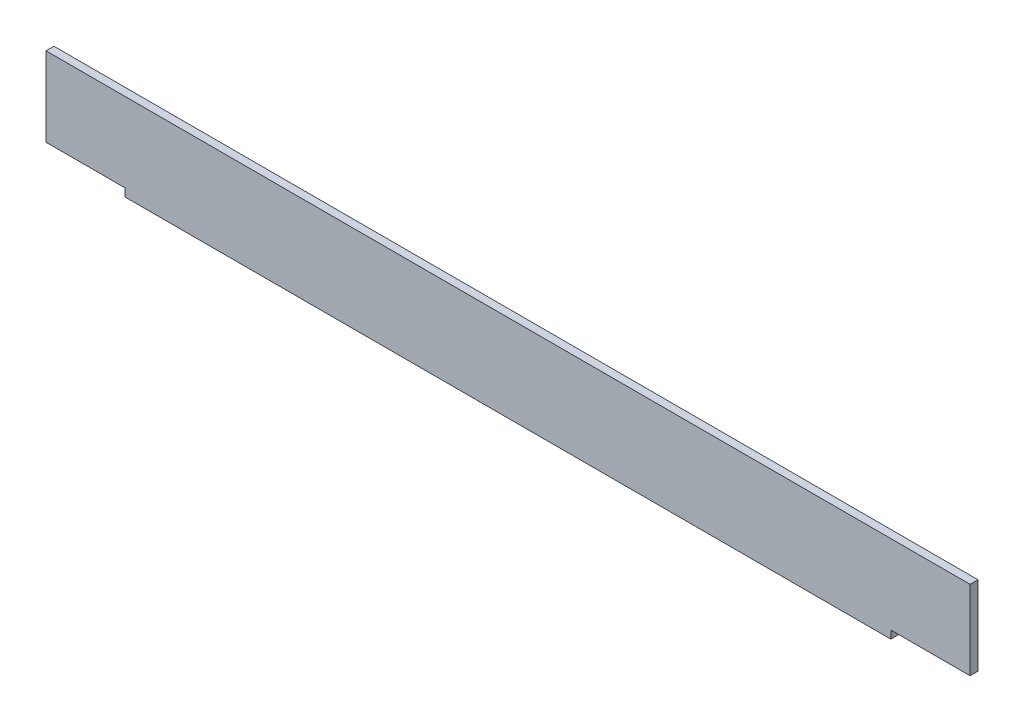
ISO-10303-21;
HEADER;
FILE_DESCRIPTION(('STEP AP214'),'2;1');
FILE_NAME('part.step','',(''),(''),'','','');
FILE_SCHEMA(('AUTOMOTIVE_DESIGN { 1 0 10303 214 1 1 1 1 }'));
ENDSEC;
DATA;
#1=APPLICATION_CONTEXT('core data for automotive mechanical design processes');
#2=APPLICATION_PROTOCOL_DEFINITION('international standard','automotive_design',2000,#1);
#3=PRODUCT_CONTEXT('',#1,'mechanical');
#4=PRODUCT('Part','Part','',(#3));
#5=PRODUCT_RELATED_PRODUCT_CATEGORY('part','',(#4));
#6=PRODUCT_DEFINITION_FORMATION('','',#4);
#7=PRODUCT_DEFINITION_CONTEXT('part definition',#1,'design');
#8=PRODUCT_DEFINITION('design','',#6,#7);
#9=PRODUCT_DEFINITION_SHAPE('','',#8);
#10=(LENGTH_UNIT() NAMED_UNIT(*) SI_UNIT(.MILLI.,.METRE.));
#11=(NAMED_UNIT(*) PLANE_ANGLE_UNIT() SI_UNIT($,.RADIAN.));
#12=(NAMED_UNIT(*) SI_UNIT($,.STERADIAN.) SOLID_ANGLE_UNIT());
#13=UNCERTAINTY_MEASURE_WITH_UNIT(LENGTH_MEASURE(1.E-05),#10,'distance_accuracy_value','');
#14=(GEOMETRIC_REPRESENTATION_CONTEXT(3) GLOBAL_UNCERTAINTY_ASSIGNED_CONTEXT((#13)) GLOBAL_UNIT_ASSIGNED_CONTEXT((#10,
#11,#12)) REPRESENTATION_CONTEXT('',''));
#15=CARTESIAN_POINT('',(0.,0.,0.));
#16=DIRECTION('',(0.,0.,1.));
#17=DIRECTION('',(1.,0.,0.));
#18=AXIS2_PLACEMENT_3D('',#15,#16,#17);
#19=CARTESIAN_POINT('',(350.,0.,0.));
#20=DIRECTION('',(0.,1.,0.));
#21=DIRECTION('',(0.,0.,1.));
#22=AXIS2_PLACEMENT_3D('',#19,#20,#21);
#23=PLANE('',#22);
#24=DIRECTION('',(-1.,0.,0.));
#25=VECTOR('',#24,1.);
#26=CARTESIAN_POINT('',(350.,0.,-33.));
#27=LINE('',#26,#25);
#28=CARTESIAN_POINT('',(320.,0.,-33.));
#29=VERTEX_POINT('',#28);
#30=CARTESIAN_POINT('',(30.,0.,-33.));
#31=VERTEX_POINT('',#30);
#32=EDGE_CURVE('E41',#29,#31,#27,.T.);
#33=ORIENTED_EDGE('',*,*,#32,.F.);
#34=DIRECTION('',(0.,0.,-1.));
#35=VECTOR('',#34,1.);
#36=CARTESIAN_POINT('',(320.,0.,-33.));
#37=LINE('',#36,#35);
#38=CARTESIAN_POINT('',(320.,0.,0.));
#39=VERTEX_POINT('',#38);
#40=EDGE_CURVE('E124',#39,#29,#37,.T.);
#41=ORIENTED_EDGE('',*,*,#40,.F.);
#42=DIRECTION('',(-1.,0.,0.));
#43=VECTOR('',#42,1.);
#44=CARTESIAN_POINT('',(350.,0.,0.));
#45=LINE('',#44,#43);
#46=CARTESIAN_POINT('',(30.,0.,0.));
#47=VERTEX_POINT('',#46);
#48=EDGE_CURVE('E128',#39,#47,#45,.T.);
#49=ORIENTED_EDGE('',*,*,#48,.T.);
#50=DIRECTION('',(0.,0.,1.));
#51=VECTOR('',#50,1.);
#52=CARTESIAN_POINT('',(30.,0.,-33.));
#53=LINE('',#52,#51);
#54=EDGE_CURVE('E167',#31,#47,#53,.T.);
#55=ORIENTED_EDGE('',*,*,#54,.F.);
#56=EDGE_LOOP('',(#33,#41,#49,#55));
#57=FACE_BOUND('',#56,.T.);
#58=ADVANCED_FACE('F34',(#57),#23,.F.);
#59=CARTESIAN_POINT('',(350.,3.,-33.));
#60=DIRECTION('',(0.,0.,-1.));
#61=DIRECTION('',(-1.,0.,0.));
#62=AXIS2_PLACEMENT_3D('',#59,#60,#61);
#63=PLANE('',#62);
#64=DIRECTION('',(0.,-1.,0.));
#65=VECTOR('',#64,1.);
#66=CARTESIAN_POINT('',(320.,3.,-33.));
#67=LINE('',#66,#65);
#68=CARTESIAN_POINT('',(320.,3.,-33.));
#69=VERTEX_POINT('',#68);
#70=EDGE_CURVE('E158',#69,#29,#67,.T.);
#71=ORIENTED_EDGE('',*,*,#70,.T.);
#72=ORIENTED_EDGE('',*,*,#32,.T.);
#73=DIRECTION('',(0.,-1.,0.));
#74=VECTOR('',#73,1.);
#75=CARTESIAN_POINT('',(30.,3.,-33.));
#76=LINE('',#75,#74);
#77=CARTESIAN_POINT('',(30.,3.,-33.));
#78=VERTEX_POINT('',#77);
#79=EDGE_CURVE('E157',#78,#31,#76,.T.);
#80=ORIENTED_EDGE('',*,*,#79,.F.);
#81=DIRECTION('',(-1.,0.,0.));
#82=VECTOR('',#81,1.);
#83=CARTESIAN_POINT('',(350.,3.,-33.));
#84=LINE('',#83,#82);
#85=EDGE_CURVE('E149',#69,#78,#84,.T.);
#86=ORIENTED_EDGE('',*,*,#85,.F.);
#87=EDGE_LOOP('',(#71,#72,#80,#86));
#88=FACE_BOUND('',#87,.T.);
#89=ADVANCED_FACE('F155',(#88),#63,.T.);
#90=CARTESIAN_POINT('',(350.,3.,0.));
#91=DIRECTION('',(0.,1.,0.));
#92=DIRECTION('',(0.,0.,1.));
#93=AXIS2_PLACEMENT_3D('',#90,#91,#92);
#94=PLANE('',#93);
#95=DIRECTION('',(0.,0.,-1.));
#96=VECTOR('',#95,1.);
#97=CARTESIAN_POINT('',(320.,3.,-33.));
#98=LINE('',#97,#96);
#99=CARTESIAN_POINT('',(320.,3.,-3.));
#100=VERTEX_POINT('',#99);
#101=EDGE_CURVE('E123',#100,#69,#98,.T.);
#102=ORIENTED_EDGE('',*,*,#101,.T.);
#103=ORIENTED_EDGE('',*,*,#85,.T.);
#104=DIRECTION('',(0.,0.,1.));
#105=VECTOR('',#104,1.);
#106=CARTESIAN_POINT('',(30.,3.,-33.));
#107=LINE('',#106,#105);
#108=CARTESIAN_POINT('',(30.,3.,-3.));
#109=VERTEX_POINT('',#108);
#110=EDGE_CURVE('E171',#78,#109,#107,.T.);
#111=ORIENTED_EDGE('',*,*,#110,.T.);
#112=DIRECTION('',(-1.,0.,0.));
#113=VECTOR('',#112,1.);
#114=CARTESIAN_POINT('',(350.,3.,-3.));
#115=LINE('',#114,#113);
#116=EDGE_CURVE('E147',#100,#109,#115,.T.);
#117=ORIENTED_EDGE('',*,*,#116,.F.);
#118=EDGE_LOOP('',(#102,#103,#111,#117));
#119=FACE_BOUND('',#118,.T.);
#120=ADVANCED_FACE('F198',(#119),#94,.T.);
#121=CARTESIAN_POINT('',(350.,33.,-3.));
#122=DIRECTION('',(0.,0.,-1.));
#123=DIRECTION('',(0.,1.,0.));
#124=AXIS2_PLACEMENT_3D('',#121,#122,#123);
#125=PLANE('',#124);
#126=DIRECTION('',(0.,-1.,0.));
#127=VECTOR('',#126,1.);
#128=CARTESIAN_POINT('',(0.,33.,-3.));
#129=LINE('',#128,#127);
#130=CARTESIAN_POINT('',(0.,33.,-3.));
#131=VERTEX_POINT('',#130);
#132=CARTESIAN_POINT('',(0.,3.,-3.));
#133=VERTEX_POINT('',#132);
#134=EDGE_CURVE('E135',#131,#133,#129,.T.);
#135=ORIENTED_EDGE('',*,*,#134,.F.);
#136=DIRECTION('',(-1.,0.,0.));
#137=VECTOR('',#136,1.);
#138=CARTESIAN_POINT('',(350.,33.,-3.));
#139=LINE('',#138,#137);
#140=CARTESIAN_POINT('',(350.,33.,-3.));
#141=VERTEX_POINT('',#140);
#142=EDGE_CURVE('E145',#141,#131,#139,.T.);
#143=ORIENTED_EDGE('',*,*,#142,.F.);
#144=DIRECTION('',(0.,-1.,0.));
#145=VECTOR('',#144,1.);
#146=CARTESIAN_POINT('',(350.,33.,-3.));
#147=LINE('',#146,#145);
#148=CARTESIAN_POINT('',(350.,3.,-3.));
#149=VERTEX_POINT('',#148);
#150=EDGE_CURVE('E131',#141,#149,#147,.T.);
#151=ORIENTED_EDGE('',*,*,#150,.T.);
#152=EDGE_CURVE('E76',#149,#100,#115,.T.);
#153=ORIENTED_EDGE('',*,*,#152,.T.);
#154=ORIENTED_EDGE('',*,*,#116,.T.);
#155=DIRECTION('',(1.,0.,0.));
#156=VECTOR('',#155,1.);
#157=CARTESIAN_POINT('',(350.,3.,-3.));
#158=LINE('',#157,#156);
#159=EDGE_CURVE('E139',#133,#109,#158,.T.);
#160=ORIENTED_EDGE('',*,*,#159,.F.);
#161=EDGE_LOOP('',(#135,#143,#151,#153,#154,#160));
#162=FACE_BOUND('',#161,.T.);
#163=ADVANCED_FACE('F186',(#162),#125,.T.);
#164=CARTESIAN_POINT('',(350.,33.,0.));
#165=DIRECTION('',(0.,1.,0.));
#166=DIRECTION('',(0.,0.,1.));
#167=AXIS2_PLACEMENT_3D('',#164,#165,#166);
#168=PLANE('',#167);
#169=DIRECTION('',(0.,0.,-1.));
#170=VECTOR('',#169,1.);
#171=CARTESIAN_POINT('',(0.,33.,0.));
#172=LINE('',#171,#170);
#173=CARTESIAN_POINT('',(0.,33.,0.));
#174=VERTEX_POINT('',#173);
#175=EDGE_CURVE('E138',#174,#131,#172,.T.);
#176=ORIENTED_EDGE('',*,*,#175,.F.);
#177=DIRECTION('',(-1.,0.,0.));
#178=VECTOR('',#177,1.);
#179=CARTESIAN_POINT('',(350.,33.,0.));
#180=LINE('',#179,#178);
#181=CARTESIAN_POINT('',(350.,33.,0.));
#182=VERTEX_POINT('',#181);
#183=EDGE_CURVE('E57',#182,#174,#180,.T.);
#184=ORIENTED_EDGE('',*,*,#183,.F.);
#185=DIRECTION('',(0.,0.,-1.));
#186=VECTOR('',#185,1.);
#187=CARTESIAN_POINT('',(350.,33.,0.));
#188=LINE('',#187,#186);
#189=EDGE_CURVE('E127',#182,#141,#188,.T.);
#190=ORIENTED_EDGE('',*,*,#189,.T.);
#191=ORIENTED_EDGE('',*,*,#142,.T.);
#192=EDGE_LOOP('',(#176,#184,#190,#191));
#193=FACE_BOUND('',#192,.T.);
#194=ADVANCED_FACE('F187',(#193),#168,.T.);
#195=CARTESIAN_POINT('',(350.,33.,0.));
#196=DIRECTION('',(0.,0.,-1.));
#197=DIRECTION('',(0.,1.,0.));
#198=AXIS2_PLACEMENT_3D('',#195,#196,#197);
#199=PLANE('',#198);
#200=ORIENTED_EDGE('',*,*,#48,.F.);
#201=DIRECTION('',(0.,-1.,0.));
#202=VECTOR('',#201,1.);
#203=CARTESIAN_POINT('',(320.,3.,0.));
#204=LINE('',#203,#202);
#205=CARTESIAN_POINT('',(320.,3.,0.));
#206=VERTEX_POINT('',#205);
#207=EDGE_CURVE('E122',#206,#39,#204,.T.);
#208=ORIENTED_EDGE('',*,*,#207,.F.);
#209=DIRECTION('',(-1.,0.,0.));
#210=VECTOR('',#209,1.);
#211=CARTESIAN_POINT('',(350.,3.,0.));
#212=LINE('',#211,#210);
#213=CARTESIAN_POINT('',(350.,3.,0.));
#214=VERTEX_POINT('',#213);
#215=EDGE_CURVE('E111',#214,#206,#212,.T.);
#216=ORIENTED_EDGE('',*,*,#215,.F.);
#217=DIRECTION('',(0.,-1.,0.));
#218=VECTOR('',#217,1.);
#219=CARTESIAN_POINT('',(350.,33.,0.));
#220=LINE('',#219,#218);
#221=EDGE_CURVE('E120',#182,#214,#220,.T.);
#222=ORIENTED_EDGE('',*,*,#221,.F.);
#223=ORIENTED_EDGE('',*,*,#183,.T.);
#224=DIRECTION('',(0.,-1.,0.));
#225=VECTOR('',#224,1.);
#226=CARTESIAN_POINT('',(0.,33.,0.));
#227=LINE('',#226,#225);
#228=CARTESIAN_POINT('',(0.,3.,0.));
#229=VERTEX_POINT('',#228);
#230=EDGE_CURVE('E142',#174,#229,#227,.T.);
#231=ORIENTED_EDGE('',*,*,#230,.T.);
#232=DIRECTION('',(-1.,0.,0.));
#233=VECTOR('',#232,1.);
#234=CARTESIAN_POINT('',(0.,3.,0.));
#235=LINE('',#234,#233);
#236=CARTESIAN_POINT('',(30.,3.,0.));
#237=VERTEX_POINT('',#236);
#238=EDGE_CURVE('E48',#237,#229,#235,.T.);
#239=ORIENTED_EDGE('',*,*,#238,.F.);
#240=DIRECTION('',(0.,-1.,0.));
#241=VECTOR('',#240,1.);
#242=CARTESIAN_POINT('',(30.,3.,0.));
#243=LINE('',#242,#241);
#244=EDGE_CURVE('E172',#237,#47,#243,.T.);
#245=ORIENTED_EDGE('',*,*,#244,.T.);
#246=EDGE_LOOP('',(#200,#208,#216,#222,#223,#231,#239,#245));
#247=FACE_BOUND('',#246,.T.);
#248=ADVANCED_FACE('F119',(#247),#199,.F.);
#249=CARTESIAN_POINT('',(350.,0.,0.));
#250=DIRECTION('',(-1.,0.,0.));
#251=DIRECTION('',(0.,0.,1.));
#252=AXIS2_PLACEMENT_3D('',#249,#250,#251);
#253=PLANE('',#252);
#254=ORIENTED_EDGE('',*,*,#221,.T.);
#255=DIRECTION('',(0.,0.,-1.));
#256=VECTOR('',#255,1.);
#257=CARTESIAN_POINT('',(350.,3.,0.));
#258=LINE('',#257,#256);
#259=EDGE_CURVE('E11',#214,#149,#258,.T.);
#260=ORIENTED_EDGE('',*,*,#259,.T.);
#261=ORIENTED_EDGE('',*,*,#150,.F.);
#262=ORIENTED_EDGE('',*,*,#189,.F.);
#263=EDGE_LOOP('',(#254,#260,#261,#262));
#264=FACE_BOUND('',#263,.T.);
#265=ADVANCED_FACE('F126',(#264),#253,.F.);
#266=CARTESIAN_POINT('',(0.,0.,0.));
#267=DIRECTION('',(-1.,0.,0.));
#268=DIRECTION('',(0.,0.,1.));
#269=AXIS2_PLACEMENT_3D('',#266,#267,#268);
#270=PLANE('',#269);
#271=DIRECTION('',(0.,0.,-1.));
#272=VECTOR('',#271,1.);
#273=CARTESIAN_POINT('',(0.,3.,-33.));
#274=LINE('',#273,#272);
#275=EDGE_CURVE('E174',#229,#133,#274,.T.);
#276=ORIENTED_EDGE('',*,*,#275,.F.);
#277=ORIENTED_EDGE('',*,*,#230,.F.);
#278=ORIENTED_EDGE('',*,*,#175,.T.);
#279=ORIENTED_EDGE('',*,*,#134,.T.);
#280=EDGE_LOOP('',(#276,#277,#278,#279));
#281=FACE_BOUND('',#280,.T.);
#282=ADVANCED_FACE('F190',(#281),#270,.T.);
#283=CARTESIAN_POINT('',(30.,3.,-33.));
#284=DIRECTION('',(1.,0.,0.));
#285=DIRECTION('',(0.,0.,-1.));
#286=AXIS2_PLACEMENT_3D('',#283,#284,#285);
#287=PLANE('',#286);
#288=ORIENTED_EDGE('',*,*,#54,.T.);
#289=ORIENTED_EDGE('',*,*,#244,.F.);
#290=EDGE_CURVE('E176',#109,#237,#107,.T.);
#291=ORIENTED_EDGE('',*,*,#290,.F.);
#292=ORIENTED_EDGE('',*,*,#110,.F.);
#293=ORIENTED_EDGE('',*,*,#79,.T.);
#294=EDGE_LOOP('',(#288,#289,#291,#292,#293));
#295=FACE_BOUND('',#294,.T.);
#296=ADVANCED_FACE('F165',(#295),#287,.F.);
#297=CARTESIAN_POINT('',(0.,3.,0.));
#298=DIRECTION('',(0.,1.,0.));
#299=DIRECTION('',(0.,0.,1.));
#300=AXIS2_PLACEMENT_3D('',#297,#298,#299);
#301=PLANE('',#300);
#302=ORIENTED_EDGE('',*,*,#159,.T.);
#303=ORIENTED_EDGE('',*,*,#290,.T.);
#304=ORIENTED_EDGE('',*,*,#238,.T.);
#305=ORIENTED_EDGE('',*,*,#275,.T.);
#306=EDGE_LOOP('',(#302,#303,#304,#305));
#307=FACE_BOUND('',#306,.T.);
#308=ADVANCED_FACE('F202',(#307),#301,.F.);
#309=CARTESIAN_POINT('',(320.,3.,-33.));
#310=DIRECTION('',(-1.,0.,0.));
#311=DIRECTION('',(0.,0.,1.));
#312=AXIS2_PLACEMENT_3D('',#309,#310,#311);
#313=PLANE('',#312);
#314=ORIENTED_EDGE('',*,*,#40,.T.);
#315=ORIENTED_EDGE('',*,*,#70,.F.);
#316=ORIENTED_EDGE('',*,*,#101,.F.);
#317=EDGE_CURVE('E194',#206,#100,#98,.T.);
#318=ORIENTED_EDGE('',*,*,#317,.F.);
#319=ORIENTED_EDGE('',*,*,#207,.T.);
#320=EDGE_LOOP('',(#314,#315,#316,#318,#319));
#321=FACE_BOUND('',#320,.T.);
#322=ADVANCED_FACE('F200',(#321),#313,.F.);
#323=CARTESIAN_POINT('',(0.,3.,0.));
#324=DIRECTION('',(0.,1.,0.));
#325=DIRECTION('',(0.,0.,1.));
#326=AXIS2_PLACEMENT_3D('',#323,#324,#325);
#327=PLANE('',#326);
#328=ORIENTED_EDGE('',*,*,#152,.F.);
#329=ORIENTED_EDGE('',*,*,#259,.F.);
#330=ORIENTED_EDGE('',*,*,#215,.T.);
#331=ORIENTED_EDGE('',*,*,#317,.T.);
#332=EDGE_LOOP('',(#328,#329,#330,#331));
#333=FACE_BOUND('',#332,.T.);
#334=ADVANCED_FACE('F110',(#333),#327,.F.);
#335=CLOSED_SHELL('',(#58,#89,#120,#163,#194,#248,#265,#282,#296,#308,#322,#334));
#336=MANIFOLD_SOLID_BREP('B2',#335);
#337=ADVANCED_BREP_SHAPE_REPRESENTATION('',(#18,#336),#14);
#338=SHAPE_DEFINITION_REPRESENTATION(#9,#337);
ENDSEC;
END-ISO-10303-21;
